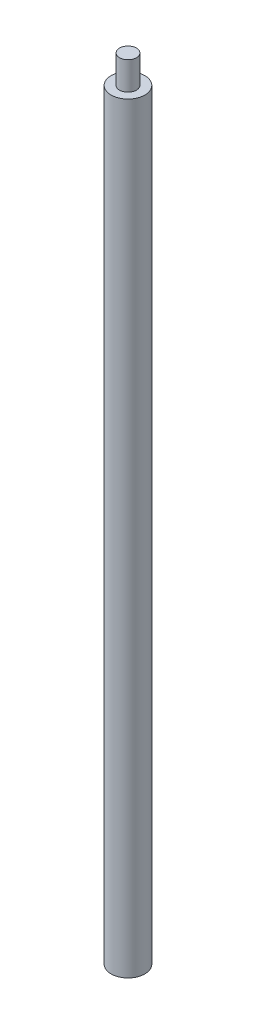
ISO-10303-21;
HEADER;
FILE_DESCRIPTION(('STEP AP214'),'2;1');
FILE_NAME('part.step','',(''),(''),'','','');
FILE_SCHEMA(('AUTOMOTIVE_DESIGN { 1 0 10303 214 1 1 1 1 }'));
ENDSEC;
DATA;
#1=APPLICATION_CONTEXT('core data for automotive mechanical design processes');
#2=APPLICATION_PROTOCOL_DEFINITION('international standard','automotive_design',2000,#1);
#3=PRODUCT_CONTEXT('',#1,'mechanical');
#4=PRODUCT('Part','Part','',(#3));
#5=PRODUCT_RELATED_PRODUCT_CATEGORY('part','',(#4));
#6=PRODUCT_DEFINITION_FORMATION('','',#4);
#7=PRODUCT_DEFINITION_CONTEXT('part definition',#1,'design');
#8=PRODUCT_DEFINITION('design','',#6,#7);
#9=PRODUCT_DEFINITION_SHAPE('','',#8);
#10=(LENGTH_UNIT() NAMED_UNIT(*) SI_UNIT(.MILLI.,.METRE.));
#11=(NAMED_UNIT(*) PLANE_ANGLE_UNIT() SI_UNIT($,.RADIAN.));
#12=(NAMED_UNIT(*) SI_UNIT($,.STERADIAN.) SOLID_ANGLE_UNIT());
#13=UNCERTAINTY_MEASURE_WITH_UNIT(LENGTH_MEASURE(1.E-05),#10,'distance_accuracy_value','');
#14=(GEOMETRIC_REPRESENTATION_CONTEXT(3) GLOBAL_UNCERTAINTY_ASSIGNED_CONTEXT((#13)) GLOBAL_UNIT_ASSIGNED_CONTEXT((#10,
#11,#12)) REPRESENTATION_CONTEXT('',''));
#15=CARTESIAN_POINT('',(0.,0.,0.));
#16=DIRECTION('',(0.,0.,1.));
#17=DIRECTION('',(1.,0.,0.));
#18=AXIS2_PLACEMENT_3D('',#15,#16,#17);
#19=CARTESIAN_POINT('',(0.,135.5,0.));
#20=DIRECTION('',(0.,1.,0.));
#21=DIRECTION('',(0.,0.,1.));
#22=AXIS2_PLACEMENT_3D('',#19,#20,#21);
#23=PLANE('',#22);
#24=CARTESIAN_POINT('',(0.,135.5,0.));
#25=DIRECTION('',(0.,1.,0.));
#26=DIRECTION('',(0.,0.,1.));
#27=AXIS2_PLACEMENT_3D('',#24,#25,#26);
#28=CIRCLE('',#27,3.);
#29=CARTESIAN_POINT('',(0.,135.5,3.));
#30=VERTEX_POINT('',#29);
#31=EDGE_CURVE('E11',#30,#30,#28,.T.);
#32=ORIENTED_EDGE('',*,*,#31,.T.);
#33=EDGE_LOOP('',(#32));
#34=FACE_BOUND('',#33,.T.);
#35=CARTESIAN_POINT('',(0.,135.5,0.));
#36=DIRECTION('',(0.,1.,0.));
#37=DIRECTION('',(0.,0.,1.));
#38=AXIS2_PLACEMENT_3D('',#35,#36,#37);
#39=CIRCLE('',#38,1.5);
#40=CARTESIAN_POINT('',(0.,135.5,1.5));
#41=VERTEX_POINT('',#40);
#42=EDGE_CURVE('E63',#41,#41,#39,.T.);
#43=ORIENTED_EDGE('',*,*,#42,.F.);
#44=EDGE_LOOP('',(#43));
#45=FACE_BOUND('',#44,.T.);
#46=ADVANCED_FACE('F36',(#34,#45),#23,.T.);
#47=CARTESIAN_POINT('',(0.,135.5,0.));
#48=DIRECTION('',(0.,-1.,0.));
#49=DIRECTION('',(0.,0.,-1.));
#50=AXIS2_PLACEMENT_3D('',#47,#48,#49);
#51=CYLINDRICAL_SURFACE('',#50,3.);
#52=ORIENTED_EDGE('',*,*,#31,.F.);
#53=EDGE_LOOP('',(#52));
#54=FACE_BOUND('',#53,.T.);
#55=CARTESIAN_POINT('',(0.,0.,0.));
#56=DIRECTION('',(0.,1.,0.));
#57=DIRECTION('',(0.,0.,1.));
#58=AXIS2_PLACEMENT_3D('',#55,#56,#57);
#59=CIRCLE('',#58,3.);
#60=CARTESIAN_POINT('',(0.,0.,3.));
#61=VERTEX_POINT('',#60);
#62=EDGE_CURVE('E40',#61,#61,#59,.T.);
#63=ORIENTED_EDGE('',*,*,#62,.T.);
#64=EDGE_LOOP('',(#63));
#65=FACE_BOUND('',#64,.T.);
#66=ADVANCED_FACE('F38',(#54,#65),#51,.T.);
#67=CARTESIAN_POINT('',(0.,0.,0.));
#68=DIRECTION('',(0.,1.,0.));
#69=DIRECTION('',(0.,0.,1.));
#70=AXIS2_PLACEMENT_3D('',#67,#68,#69);
#71=PLANE('',#70);
#72=CARTESIAN_POINT('',(0.,0.,0.));
#73=DIRECTION('',(0.,-1.,0.));
#74=DIRECTION('',(0.,0.,-1.));
#75=AXIS2_PLACEMENT_3D('',#72,#73,#74);
#76=CIRCLE('',#75,1.24999999999999);
#77=CARTESIAN_POINT('',(0.,0.,-1.24999999999999));
#78=VERTEX_POINT('',#77);
#79=EDGE_CURVE('E56',#78,#78,#76,.T.);
#80=ORIENTED_EDGE('',*,*,#79,.F.);
#81=EDGE_LOOP('',(#80));
#82=FACE_BOUND('',#81,.T.);
#83=ORIENTED_EDGE('',*,*,#62,.F.);
#84=EDGE_LOOP('',(#83));
#85=FACE_BOUND('',#84,.T.);
#86=ADVANCED_FACE('F50',(#82,#85),#71,.F.);
#87=CARTESIAN_POINT('',(0.,18.5,0.));
#88=DIRECTION('',(0.,-1.,0.));
#89=DIRECTION('',(0.,0.,-1.));
#90=AXIS2_PLACEMENT_3D('',#87,#88,#89);
#91=CONICAL_SURFACE('',#90,1.25,1.02974425867665);
#92=CARTESIAN_POINT('',(0.,19.2510757737845,0.));
#93=VERTEX_POINT('',#92);
#94=VERTEX_LOOP('',#93);
#95=FACE_BOUND('',#94,.T.);
#96=CARTESIAN_POINT('',(0.,18.5,0.));
#97=DIRECTION('',(0.,-1.,0.));
#98=DIRECTION('',(0.,0.,-1.));
#99=AXIS2_PLACEMENT_3D('',#96,#97,#98);
#100=CIRCLE('',#99,1.25);
#101=CARTESIAN_POINT('',(0.,18.5,-1.25));
#102=VERTEX_POINT('',#101);
#103=EDGE_CURVE('E54',#102,#102,#100,.T.);
#104=ORIENTED_EDGE('',*,*,#103,.T.);
#105=EDGE_LOOP('',(#104));
#106=FACE_BOUND('',#105,.T.);
#107=ADVANCED_FACE('F46',(#95,#106),#91,.F.);
#108=CARTESIAN_POINT('',(0.,0.,0.));
#109=DIRECTION('',(0.,-1.,0.));
#110=DIRECTION('',(0.,0.,-1.));
#111=AXIS2_PLACEMENT_3D('',#108,#109,#110);
#112=CYLINDRICAL_SURFACE('',#111,1.24999999999999);
#113=ORIENTED_EDGE('',*,*,#103,.F.);
#114=EDGE_LOOP('',(#113));
#115=FACE_BOUND('',#114,.T.);
#116=ORIENTED_EDGE('',*,*,#79,.T.);
#117=EDGE_LOOP('',(#116));
#118=FACE_BOUND('',#117,.T.);
#119=ADVANCED_FACE('F49',(#115,#118),#112,.F.);
#120=CARTESIAN_POINT('',(0.,140.5,0.));
#121=DIRECTION('',(0.,-1.,0.));
#122=DIRECTION('',(0.,0.,-1.));
#123=AXIS2_PLACEMENT_3D('',#120,#121,#122);
#124=CYLINDRICAL_SURFACE('',#123,1.5);
#125=CARTESIAN_POINT('',(0.,140.5,0.));
#126=DIRECTION('',(0.,1.,0.));
#127=DIRECTION('',(0.,0.,1.));
#128=AXIS2_PLACEMENT_3D('',#125,#126,#127);
#129=CIRCLE('',#128,1.5);
#130=CARTESIAN_POINT('',(0.,140.5,1.5));
#131=VERTEX_POINT('',#130);
#132=EDGE_CURVE('E60',#131,#131,#129,.T.);
#133=ORIENTED_EDGE('',*,*,#132,.F.);
#134=EDGE_LOOP('',(#133));
#135=FACE_BOUND('',#134,.T.);
#136=ORIENTED_EDGE('',*,*,#42,.T.);
#137=EDGE_LOOP('',(#136));
#138=FACE_BOUND('',#137,.T.);
#139=ADVANCED_FACE('F71',(#135,#138),#124,.T.);
#140=CARTESIAN_POINT('',(0.,140.5,0.));
#141=DIRECTION('',(0.,1.,0.));
#142=DIRECTION('',(0.,0.,1.));
#143=AXIS2_PLACEMENT_3D('',#140,#141,#142);
#144=PLANE('',#143);
#145=ORIENTED_EDGE('',*,*,#132,.T.);
#146=EDGE_LOOP('',(#145));
#147=FACE_BOUND('',#146,.T.);
#148=ADVANCED_FACE('F69',(#147),#144,.T.);
#149=CLOSED_SHELL('',(#46,#66,#86,#107,#119,#139,#148));
#150=MANIFOLD_SOLID_BREP('B2',#149);
#151=ADVANCED_BREP_SHAPE_REPRESENTATION('',(#18,#150),#14);
#152=SHAPE_DEFINITION_REPRESENTATION(#9,#151);
ENDSEC;
END-ISO-10303-21;
